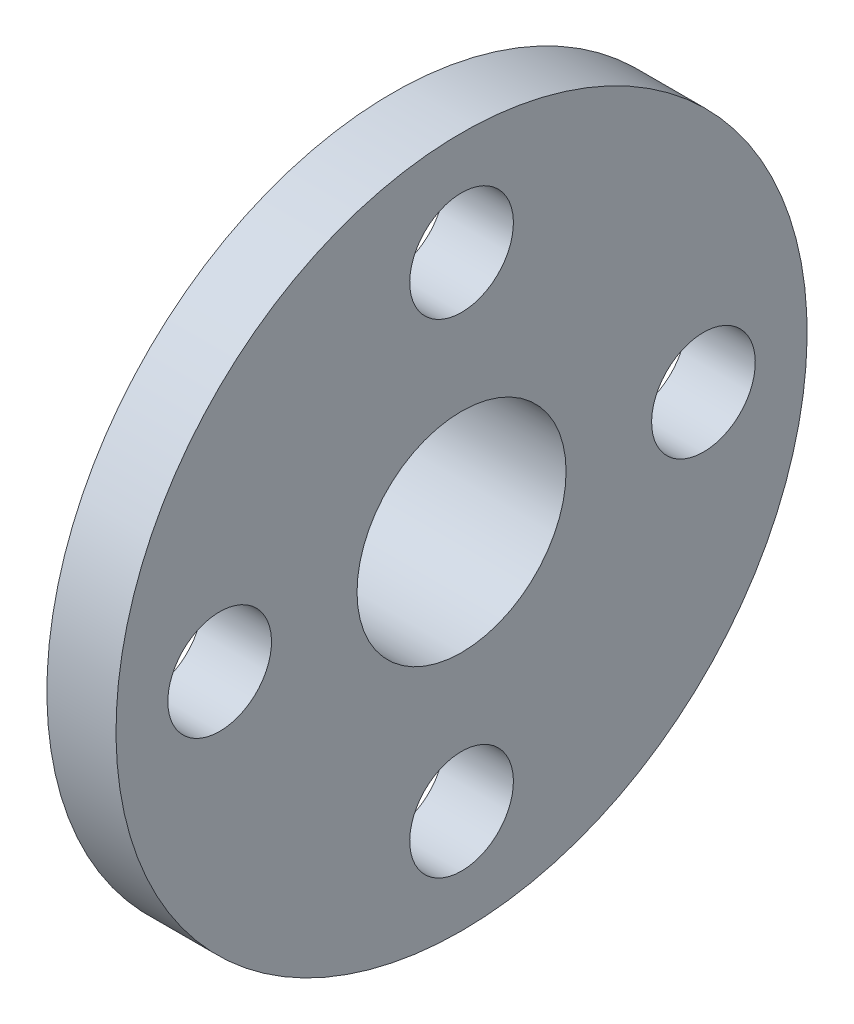
ISO-10303-21;
HEADER;
FILE_DESCRIPTION(('STEP AP214'),'2;1');
FILE_NAME('part.step','',(''),(''),'','','');
FILE_SCHEMA(('AUTOMOTIVE_DESIGN { 1 0 10303 214 1 1 1 1 }'));
ENDSEC;
DATA;
#1=APPLICATION_CONTEXT('core data for automotive mechanical design processes');
#2=APPLICATION_PROTOCOL_DEFINITION('international standard','automotive_design',2000,#1);
#3=PRODUCT_CONTEXT('',#1,'mechanical');
#4=PRODUCT('Part','Part','',(#3));
#5=PRODUCT_RELATED_PRODUCT_CATEGORY('part','',(#4));
#6=PRODUCT_DEFINITION_FORMATION('','',#4);
#7=PRODUCT_DEFINITION_CONTEXT('part definition',#1,'design');
#8=PRODUCT_DEFINITION('design','',#6,#7);
#9=PRODUCT_DEFINITION_SHAPE('','',#8);
#10=(LENGTH_UNIT() NAMED_UNIT(*) SI_UNIT(.MILLI.,.METRE.));
#11=(NAMED_UNIT(*) PLANE_ANGLE_UNIT() SI_UNIT($,.RADIAN.));
#12=(NAMED_UNIT(*) SI_UNIT($,.STERADIAN.) SOLID_ANGLE_UNIT());
#13=UNCERTAINTY_MEASURE_WITH_UNIT(LENGTH_MEASURE(1.E-05),#10,'distance_accuracy_value','');
#14=(GEOMETRIC_REPRESENTATION_CONTEXT(3) GLOBAL_UNCERTAINTY_ASSIGNED_CONTEXT((#13)) GLOBAL_UNIT_ASSIGNED_CONTEXT((#10,
#11,#12)) REPRESENTATION_CONTEXT('',''));
#15=CARTESIAN_POINT('',(0.,0.,0.));
#16=DIRECTION('',(0.,0.,1.));
#17=DIRECTION('',(1.,0.,0.));
#18=AXIS2_PLACEMENT_3D('',#15,#16,#17);
#19=CARTESIAN_POINT('',(1.5,10.0000001490116,40.0000005960464));
#20=DIRECTION('',(1.,0.,0.));
#21=DIRECTION('',(0.,1.,0.));
#22=AXIS2_PLACEMENT_3D('',#19,#20,#21);
#23=PLANE('',#22);
#24=CARTESIAN_POINT('',(1.5,10.0000001490116,40.0000005960464));
#25=DIRECTION('',(1.,0.,0.));
#26=DIRECTION('',(0.,1.,0.));
#27=AXIS2_PLACEMENT_3D('',#24,#25,#26);
#28=CIRCLE('',#27,3.025);
#29=CARTESIAN_POINT('',(1.5,6.97500014901161,40.0000005960464));
#30=VERTEX_POINT('',#29);
#31=EDGE_CURVE('E143',#30,#30,#28,.T.);
#32=ORIENTED_EDGE('',*,*,#31,.T.);
#33=EDGE_LOOP('',(#32));
#34=FACE_BOUND('',#33,.T.);
#35=CARTESIAN_POINT('',(1.5,10.0000001490116,40.0000005960464));
#36=DIRECTION('',(-1.,0.,0.));
#37=DIRECTION('',(0.,1.,0.));
#38=AXIS2_PLACEMENT_3D('',#35,#36,#37);
#39=CIRCLE('',#38,4.5);
#40=CARTESIAN_POINT('',(1.5,5.50000014901161,40.0000005960464));
#41=VERTEX_POINT('',#40);
#42=EDGE_CURVE('E26',#41,#41,#39,.T.);
#43=ORIENTED_EDGE('',*,*,#42,.T.);
#44=EDGE_LOOP('',(#43));
#45=FACE_BOUND('',#44,.T.);
#46=ADVANCED_FACE('F15',(#34,#45),#23,.F.);
#47=CARTESIAN_POINT('',(4.,10.0000001490116,40.0000005960464));
#48=DIRECTION('',(-1.,0.,0.));
#49=DIRECTION('',(0.,1.,0.));
#50=AXIS2_PLACEMENT_3D('',#47,#48,#49);
#51=CYLINDRICAL_SURFACE('',#50,4.5);
#52=ORIENTED_EDGE('',*,*,#42,.F.);
#53=DIRECTION('',(1.,0.,0.));
#54=VECTOR('',#53,1.);
#55=CARTESIAN_POINT('',(4.,5.50000014901161,40.0000005960464));
#56=LINE('',#55,#54);
#57=CARTESIAN_POINT('',(4.,5.50000014901161,40.0000005960464));
#58=VERTEX_POINT('',#57);
#59=EDGE_CURVE('E10',#41,#58,#56,.T.);
#60=ORIENTED_EDGE('',*,*,#59,.T.);
#61=CARTESIAN_POINT('',(4.,10.0000001490116,40.0000005960464));
#62=DIRECTION('',(1.,0.,0.));
#63=DIRECTION('',(0.,1.,0.));
#64=AXIS2_PLACEMENT_3D('',#61,#62,#63);
#65=CIRCLE('',#64,4.5);
#66=EDGE_CURVE('E126',#58,#58,#65,.T.);
#67=ORIENTED_EDGE('',*,*,#66,.F.);
#68=ORIENTED_EDGE('',*,*,#59,.F.);
#69=EDGE_LOOP('',(#52,#60,#67,#68));
#70=FACE_BOUND('',#69,.T.);
#71=ADVANCED_FACE('F193',(#70),#51,.T.);
#72=CARTESIAN_POINT('',(4.,10.0000001490116,40.0000005960464));
#73=DIRECTION('',(-1.,0.,0.));
#74=DIRECTION('',(0.,1.,0.));
#75=AXIS2_PLACEMENT_3D('',#72,#73,#74);
#76=CYLINDRICAL_SURFACE('',#75,3.025);
#77=ORIENTED_EDGE('',*,*,#31,.F.);
#78=DIRECTION('',(1.,0.,0.));
#79=VECTOR('',#78,1.);
#80=CARTESIAN_POINT('',(4.,6.97500014901161,40.0000005960464));
#81=LINE('',#80,#79);
#82=CARTESIAN_POINT('',(6.,6.97500014901161,40.0000005960464));
#83=VERTEX_POINT('',#82);
#84=EDGE_CURVE('E19',#30,#83,#81,.T.);
#85=ORIENTED_EDGE('',*,*,#84,.T.);
#86=CARTESIAN_POINT('',(6.,10.0000001490116,40.0000005960464));
#87=DIRECTION('',(-1.,0.,0.));
#88=DIRECTION('',(0.,1.,0.));
#89=AXIS2_PLACEMENT_3D('',#86,#87,#88);
#90=CIRCLE('',#89,3.025);
#91=EDGE_CURVE('E116',#83,#83,#90,.T.);
#92=ORIENTED_EDGE('',*,*,#91,.F.);
#93=ORIENTED_EDGE('',*,*,#84,.F.);
#94=EDGE_LOOP('',(#77,#85,#92,#93));
#95=FACE_BOUND('',#94,.T.);
#96=ADVANCED_FACE('F197',(#95),#76,.F.);
#97=CARTESIAN_POINT('',(6.,10.0000001490116,40.0000005960464));
#98=DIRECTION('',(1.,0.,0.));
#99=DIRECTION('',(0.,1.,0.));
#100=AXIS2_PLACEMENT_3D('',#97,#98,#99);
#101=PLANE('',#100);
#102=ORIENTED_EDGE('',*,*,#91,.T.);
#103=EDGE_LOOP('',(#102));
#104=FACE_BOUND('',#103,.T.);
#105=CARTESIAN_POINT('',(6.,10.0000001490116,33.0000005960464));
#106=DIRECTION('',(-1.,0.,0.));
#107=DIRECTION('',(0.,1.,0.));
#108=AXIS2_PLACEMENT_3D('',#105,#106,#107);
#109=CIRCLE('',#108,1.5);
#110=CARTESIAN_POINT('',(6.,8.50000014901161,33.0000005960464));
#111=VERTEX_POINT('',#110);
#112=EDGE_CURVE('E127',#111,#111,#109,.T.);
#113=ORIENTED_EDGE('',*,*,#112,.T.);
#114=EDGE_LOOP('',(#113));
#115=FACE_BOUND('',#114,.T.);
#116=CARTESIAN_POINT('',(6.,10.0000001490116,47.0000005960464));
#117=DIRECTION('',(-1.,0.,0.));
#118=DIRECTION('',(0.,1.,0.));
#119=AXIS2_PLACEMENT_3D('',#116,#117,#118);
#120=CIRCLE('',#119,1.5);
#121=CARTESIAN_POINT('',(6.,8.50000014901161,47.0000005960464));
#122=VERTEX_POINT('',#121);
#123=EDGE_CURVE('E85',#122,#122,#120,.T.);
#124=ORIENTED_EDGE('',*,*,#123,.T.);
#125=EDGE_LOOP('',(#124));
#126=FACE_BOUND('',#125,.T.);
#127=CARTESIAN_POINT('',(6.,17.0000001490116,40.0000005960464));
#128=DIRECTION('',(-1.,0.,0.));
#129=DIRECTION('',(0.,1.,0.));
#130=AXIS2_PLACEMENT_3D('',#127,#128,#129);
#131=CIRCLE('',#130,1.5);
#132=CARTESIAN_POINT('',(6.,15.5000001490116,40.0000005960464));
#133=VERTEX_POINT('',#132);
#134=EDGE_CURVE('E102',#133,#133,#131,.T.);
#135=ORIENTED_EDGE('',*,*,#134,.T.);
#136=EDGE_LOOP('',(#135));
#137=FACE_BOUND('',#136,.T.);
#138=CARTESIAN_POINT('',(6.,3.00000014901161,40.0000005960464));
#139=DIRECTION('',(-1.,0.,0.));
#140=DIRECTION('',(0.,1.,0.));
#141=AXIS2_PLACEMENT_3D('',#138,#139,#140);
#142=CIRCLE('',#141,1.5);
#143=CARTESIAN_POINT('',(6.,1.50000014901161,40.0000005960464));
#144=VERTEX_POINT('',#143);
#145=EDGE_CURVE('E122',#144,#144,#142,.T.);
#146=ORIENTED_EDGE('',*,*,#145,.T.);
#147=EDGE_LOOP('',(#146));
#148=FACE_BOUND('',#147,.T.);
#149=CARTESIAN_POINT('',(6.,10.0000001490116,40.0000005960464));
#150=DIRECTION('',(1.,0.,0.));
#151=DIRECTION('',(0.,1.,0.));
#152=AXIS2_PLACEMENT_3D('',#149,#150,#151);
#153=CIRCLE('',#152,10.);
#154=CARTESIAN_POINT('',(6.,1.49011611938477E-07,40.0000005960464));
#155=VERTEX_POINT('',#154);
#156=EDGE_CURVE('E117',#155,#155,#153,.T.);
#157=ORIENTED_EDGE('',*,*,#156,.T.);
#158=EDGE_LOOP('',(#157));
#159=FACE_BOUND('',#158,.T.);
#160=ADVANCED_FACE('F188',(#104,#115,#126,#137,#148,#159),#101,.T.);
#161=CARTESIAN_POINT('',(4.,10.0000001490116,40.0000005960464));
#162=DIRECTION('',(1.,0.,0.));
#163=DIRECTION('',(0.,1.,0.));
#164=AXIS2_PLACEMENT_3D('',#161,#162,#163);
#165=CYLINDRICAL_SURFACE('',#164,10.);
#166=ORIENTED_EDGE('',*,*,#156,.F.);
#167=DIRECTION('',(-1.,0.,0.));
#168=VECTOR('',#167,1.);
#169=CARTESIAN_POINT('',(4.,1.49011611938477E-07,40.0000005960464));
#170=LINE('',#169,#168);
#171=CARTESIAN_POINT('',(4.,1.49011611938477E-07,40.0000005960464));
#172=VERTEX_POINT('',#171);
#173=EDGE_CURVE('E113',#155,#172,#170,.T.);
#174=ORIENTED_EDGE('',*,*,#173,.T.);
#175=CARTESIAN_POINT('',(4.,10.0000001490116,40.0000005960464));
#176=DIRECTION('',(1.,0.,0.));
#177=DIRECTION('',(0.,1.,0.));
#178=AXIS2_PLACEMENT_3D('',#175,#176,#177);
#179=CIRCLE('',#178,10.);
#180=EDGE_CURVE('E123',#172,#172,#179,.T.);
#181=ORIENTED_EDGE('',*,*,#180,.T.);
#182=ORIENTED_EDGE('',*,*,#173,.F.);
#183=EDGE_LOOP('',(#166,#174,#181,#182));
#184=FACE_BOUND('',#183,.T.);
#185=ADVANCED_FACE('F180',(#184),#165,.T.);
#186=CARTESIAN_POINT('',(4.,10.0000001490116,40.0000005960464));
#187=DIRECTION('',(1.,0.,0.));
#188=DIRECTION('',(0.,1.,0.));
#189=AXIS2_PLACEMENT_3D('',#186,#187,#188);
#190=PLANE('',#189);
#191=ORIENTED_EDGE('',*,*,#66,.T.);
#192=EDGE_LOOP('',(#191));
#193=FACE_BOUND('',#192,.T.);
#194=CARTESIAN_POINT('',(4.,10.0000001490116,33.0000005960464));
#195=DIRECTION('',(1.,0.,0.));
#196=DIRECTION('',(0.,1.,0.));
#197=AXIS2_PLACEMENT_3D('',#194,#195,#196);
#198=CIRCLE('',#197,1.5);
#199=CARTESIAN_POINT('',(4.,8.50000014901161,33.0000005960464));
#200=VERTEX_POINT('',#199);
#201=EDGE_CURVE('E130',#200,#200,#198,.T.);
#202=ORIENTED_EDGE('',*,*,#201,.T.);
#203=EDGE_LOOP('',(#202));
#204=FACE_BOUND('',#203,.T.);
#205=CARTESIAN_POINT('',(4.,10.0000001490116,47.0000005960464));
#206=DIRECTION('',(1.,0.,0.));
#207=DIRECTION('',(0.,1.,0.));
#208=AXIS2_PLACEMENT_3D('',#205,#206,#207);
#209=CIRCLE('',#208,1.5);
#210=CARTESIAN_POINT('',(4.,8.50000014901161,47.0000005960464));
#211=VERTEX_POINT('',#210);
#212=EDGE_CURVE('E95',#211,#211,#209,.T.);
#213=ORIENTED_EDGE('',*,*,#212,.T.);
#214=EDGE_LOOP('',(#213));
#215=FACE_BOUND('',#214,.T.);
#216=CARTESIAN_POINT('',(4.,17.0000001490116,40.0000005960464));
#217=DIRECTION('',(1.,0.,0.));
#218=DIRECTION('',(0.,1.,0.));
#219=AXIS2_PLACEMENT_3D('',#216,#217,#218);
#220=CIRCLE('',#219,1.5);
#221=CARTESIAN_POINT('',(4.,15.5000001490116,40.0000005960464));
#222=VERTEX_POINT('',#221);
#223=EDGE_CURVE('E118',#222,#222,#220,.T.);
#224=ORIENTED_EDGE('',*,*,#223,.T.);
#225=EDGE_LOOP('',(#224));
#226=FACE_BOUND('',#225,.T.);
#227=CARTESIAN_POINT('',(4.,3.00000014901161,40.0000005960464));
#228=DIRECTION('',(1.,0.,0.));
#229=DIRECTION('',(0.,1.,0.));
#230=AXIS2_PLACEMENT_3D('',#227,#228,#229);
#231=CIRCLE('',#230,1.5);
#232=CARTESIAN_POINT('',(4.,1.50000014901161,40.0000005960464));
#233=VERTEX_POINT('',#232);
#234=EDGE_CURVE('E134',#233,#233,#231,.T.);
#235=ORIENTED_EDGE('',*,*,#234,.T.);
#236=EDGE_LOOP('',(#235));
#237=FACE_BOUND('',#236,.T.);
#238=ORIENTED_EDGE('',*,*,#180,.F.);
#239=EDGE_LOOP('',(#238));
#240=FACE_BOUND('',#239,.T.);
#241=ADVANCED_FACE('F99',(#193,#204,#215,#226,#237,#240),#190,.F.);
#242=CARTESIAN_POINT('',(4.,10.0000001490116,33.0000005960464));
#243=DIRECTION('',(1.,0.,0.));
#244=DIRECTION('',(0.,1.,0.));
#245=AXIS2_PLACEMENT_3D('',#242,#243,#244);
#246=CYLINDRICAL_SURFACE('',#245,1.5);
#247=ORIENTED_EDGE('',*,*,#201,.F.);
#248=DIRECTION('',(1.,0.,0.));
#249=VECTOR('',#248,1.);
#250=CARTESIAN_POINT('',(4.,8.50000014901161,33.0000005960464));
#251=LINE('',#250,#249);
#252=EDGE_CURVE('E165',#200,#111,#251,.T.);
#253=ORIENTED_EDGE('',*,*,#252,.T.);
#254=ORIENTED_EDGE('',*,*,#112,.F.);
#255=ORIENTED_EDGE('',*,*,#252,.F.);
#256=EDGE_LOOP('',(#247,#253,#254,#255));
#257=FACE_BOUND('',#256,.T.);
#258=ADVANCED_FACE('F17',(#257),#246,.F.);
#259=CARTESIAN_POINT('',(4.,10.0000001490116,47.0000005960464));
#260=DIRECTION('',(1.,0.,0.));
#261=DIRECTION('',(0.,1.,0.));
#262=AXIS2_PLACEMENT_3D('',#259,#260,#261);
#263=CYLINDRICAL_SURFACE('',#262,1.5);
#264=ORIENTED_EDGE('',*,*,#212,.F.);
#265=DIRECTION('',(1.,0.,0.));
#266=VECTOR('',#265,1.);
#267=CARTESIAN_POINT('',(4.,8.50000014901161,47.0000005960464));
#268=LINE('',#267,#266);
#269=EDGE_CURVE('E92',#211,#122,#268,.T.);
#270=ORIENTED_EDGE('',*,*,#269,.T.);
#271=ORIENTED_EDGE('',*,*,#123,.F.);
#272=ORIENTED_EDGE('',*,*,#269,.F.);
#273=EDGE_LOOP('',(#264,#270,#271,#272));
#274=FACE_BOUND('',#273,.T.);
#275=ADVANCED_FACE('F94',(#274),#263,.F.);
#276=CARTESIAN_POINT('',(4.,17.0000001490116,40.0000005960464));
#277=DIRECTION('',(1.,0.,0.));
#278=DIRECTION('',(0.,1.,0.));
#279=AXIS2_PLACEMENT_3D('',#276,#277,#278);
#280=CYLINDRICAL_SURFACE('',#279,1.5);
#281=ORIENTED_EDGE('',*,*,#223,.F.);
#282=DIRECTION('',(1.,0.,0.));
#283=VECTOR('',#282,1.);
#284=CARTESIAN_POINT('',(4.,15.5000001490116,40.0000005960464));
#285=LINE('',#284,#283);
#286=EDGE_CURVE('E108',#222,#133,#285,.T.);
#287=ORIENTED_EDGE('',*,*,#286,.T.);
#288=ORIENTED_EDGE('',*,*,#134,.F.);
#289=ORIENTED_EDGE('',*,*,#286,.F.);
#290=EDGE_LOOP('',(#281,#287,#288,#289));
#291=FACE_BOUND('',#290,.T.);
#292=ADVANCED_FACE('F200',(#291),#280,.F.);
#293=CARTESIAN_POINT('',(4.,3.00000014901161,40.0000005960464));
#294=DIRECTION('',(1.,0.,0.));
#295=DIRECTION('',(0.,1.,0.));
#296=AXIS2_PLACEMENT_3D('',#293,#294,#295);
#297=CYLINDRICAL_SURFACE('',#296,1.5);
#298=ORIENTED_EDGE('',*,*,#234,.F.);
#299=DIRECTION('',(1.,0.,0.));
#300=VECTOR('',#299,1.);
#301=CARTESIAN_POINT('',(4.,1.50000014901161,40.0000005960464));
#302=LINE('',#301,#300);
#303=EDGE_CURVE('E138',#233,#144,#302,.T.);
#304=ORIENTED_EDGE('',*,*,#303,.T.);
#305=ORIENTED_EDGE('',*,*,#145,.F.);
#306=ORIENTED_EDGE('',*,*,#303,.F.);
#307=EDGE_LOOP('',(#298,#304,#305,#306));
#308=FACE_BOUND('',#307,.T.);
#309=ADVANCED_FACE('F203',(#308),#297,.F.);
#310=CLOSED_SHELL('',(#46,#71,#96,#160,#185,#241,#258,#275,#292,#309));
#311=MANIFOLD_SOLID_BREP('B1',#310);
#312=ADVANCED_BREP_SHAPE_REPRESENTATION('',(#18,#311),#14);
#313=SHAPE_DEFINITION_REPRESENTATION(#9,#312);
ENDSEC;
END-ISO-10303-21;
